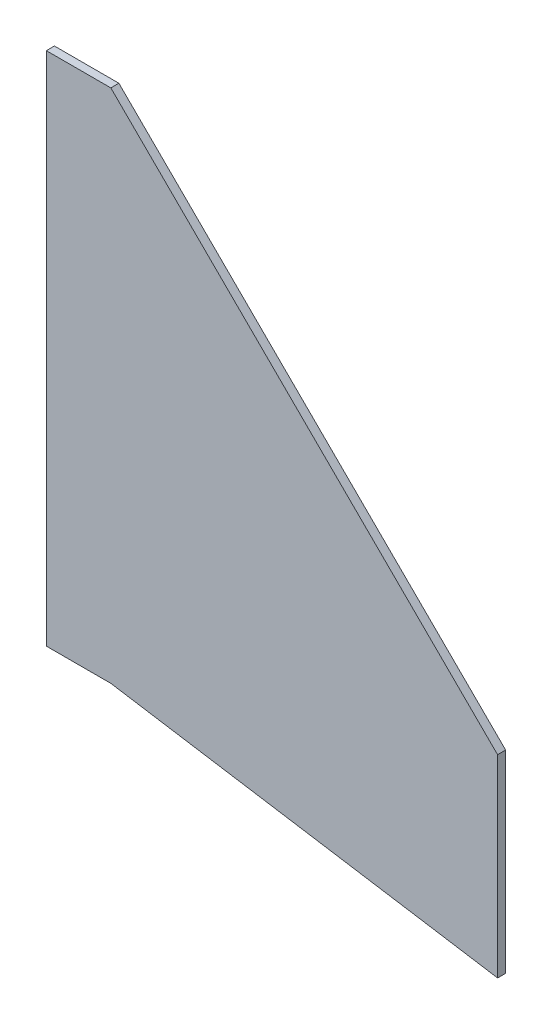
ISO-10303-21;
HEADER;
FILE_DESCRIPTION(('STEP AP214'),'2;1');
FILE_NAME('part.step','',(''),(''),'','','');
FILE_SCHEMA(('AUTOMOTIVE_DESIGN { 1 0 10303 214 1 1 1 1 }'));
ENDSEC;
DATA;
#1=APPLICATION_CONTEXT('core data for automotive mechanical design processes');
#2=APPLICATION_PROTOCOL_DEFINITION('international standard','automotive_design',2000,#1);
#3=PRODUCT_CONTEXT('',#1,'mechanical');
#4=PRODUCT('Part','Part','',(#3));
#5=PRODUCT_RELATED_PRODUCT_CATEGORY('part','',(#4));
#6=PRODUCT_DEFINITION_FORMATION('','',#4);
#7=PRODUCT_DEFINITION_CONTEXT('part definition',#1,'design');
#8=PRODUCT_DEFINITION('design','',#6,#7);
#9=PRODUCT_DEFINITION_SHAPE('','',#8);
#10=(LENGTH_UNIT() NAMED_UNIT(*) SI_UNIT(.MILLI.,.METRE.));
#11=(NAMED_UNIT(*) PLANE_ANGLE_UNIT() SI_UNIT($,.RADIAN.));
#12=(NAMED_UNIT(*) SI_UNIT($,.STERADIAN.) SOLID_ANGLE_UNIT());
#13=UNCERTAINTY_MEASURE_WITH_UNIT(LENGTH_MEASURE(1.E-05),#10,'distance_accuracy_value','');
#14=(GEOMETRIC_REPRESENTATION_CONTEXT(3) GLOBAL_UNCERTAINTY_ASSIGNED_CONTEXT((#13)) GLOBAL_UNIT_ASSIGNED_CONTEXT((#10,
#11,#12)) REPRESENTATION_CONTEXT('',''));
#15=CARTESIAN_POINT('',(0.,0.,0.));
#16=DIRECTION('',(0.,0.,1.));
#17=DIRECTION('',(1.,0.,0.));
#18=AXIS2_PLACEMENT_3D('',#15,#16,#17);
#19=CARTESIAN_POINT('',(-25.4,0.,1.5875));
#20=DIRECTION('',(1.,0.,0.));
#21=DIRECTION('',(0.,1.,0.));
#22=AXIS2_PLACEMENT_3D('',#19,#20,#21);
#23=PLANE('',#22);
#24=DIRECTION('',(0.,-1.,0.));
#25=VECTOR('',#24,1.);
#26=CARTESIAN_POINT('',(-25.4,0.,-1.5875));
#27=LINE('',#26,#25);
#28=CARTESIAN_POINT('',(-25.4,0.,-1.5875));
#29=VERTEX_POINT('',#28);
#30=CARTESIAN_POINT('',(-25.4,-203.2,-1.5875));
#31=VERTEX_POINT('',#30);
#32=EDGE_CURVE('E123',#29,#31,#27,.T.);
#33=ORIENTED_EDGE('',*,*,#32,.T.);
#34=DIRECTION('',(0.,0.,-1.));
#35=VECTOR('',#34,1.);
#36=CARTESIAN_POINT('',(-25.4,-203.2,1.5875));
#37=LINE('',#36,#35);
#38=CARTESIAN_POINT('',(-25.4,-203.2,1.5875));
#39=VERTEX_POINT('',#38);
#40=EDGE_CURVE('E11',#39,#31,#37,.T.);
#41=ORIENTED_EDGE('',*,*,#40,.F.);
#42=DIRECTION('',(0.,-1.,0.));
#43=VECTOR('',#42,1.);
#44=CARTESIAN_POINT('',(-25.4,0.,1.5875));
#45=LINE('',#44,#43);
#46=CARTESIAN_POINT('',(-25.4,0.,1.5875));
#47=VERTEX_POINT('',#46);
#48=EDGE_CURVE('E133',#47,#39,#45,.T.);
#49=ORIENTED_EDGE('',*,*,#48,.F.);
#50=DIRECTION('',(0.,0.,-1.));
#51=VECTOR('',#50,1.);
#52=CARTESIAN_POINT('',(-25.4,0.,1.5875));
#53=LINE('',#52,#51);
#54=EDGE_CURVE('E119',#47,#29,#53,.T.);
#55=ORIENTED_EDGE('',*,*,#54,.T.);
#56=EDGE_LOOP('',(#33,#41,#49,#55));
#57=FACE_BOUND('',#56,.T.);
#58=ADVANCED_FACE('F39',(#57),#23,.F.);
#59=CARTESIAN_POINT('',(0.,-203.2,1.5875));
#60=DIRECTION('',(0.,1.,0.));
#61=DIRECTION('',(0.,0.,1.));
#62=AXIS2_PLACEMENT_3D('',#59,#60,#61);
#63=PLANE('',#62);
#64=DIRECTION('',(1.,0.,0.));
#65=VECTOR('',#64,1.);
#66=CARTESIAN_POINT('',(0.,-203.2,-1.5875));
#67=LINE('',#66,#65);
#68=CARTESIAN_POINT('',(0.,-203.2,-1.5875));
#69=VERTEX_POINT('',#68);
#70=EDGE_CURVE('E126',#31,#69,#67,.T.);
#71=ORIENTED_EDGE('',*,*,#70,.T.);
#72=DIRECTION('',(0.,0.,-1.));
#73=VECTOR('',#72,1.);
#74=CARTESIAN_POINT('',(0.,-203.2,1.5875));
#75=LINE('',#74,#73);
#76=CARTESIAN_POINT('',(0.,-203.2,1.5875));
#77=VERTEX_POINT('',#76);
#78=EDGE_CURVE('E47',#77,#69,#75,.T.);
#79=ORIENTED_EDGE('',*,*,#78,.F.);
#80=DIRECTION('',(1.,0.,0.));
#81=VECTOR('',#80,1.);
#82=CARTESIAN_POINT('',(0.,-203.2,1.5875));
#83=LINE('',#82,#81);
#84=EDGE_CURVE('E92',#39,#77,#83,.T.);
#85=ORIENTED_EDGE('',*,*,#84,.F.);
#86=ORIENTED_EDGE('',*,*,#40,.T.);
#87=EDGE_LOOP('',(#71,#79,#85,#86));
#88=FACE_BOUND('',#87,.T.);
#89=ADVANCED_FACE('F157',(#88),#63,.F.);
#90=CARTESIAN_POINT('',(-31.6457975960785,-198.14586213043,1.5875));
#91=DIRECTION('',(0.157710892889718,0.987485328632243,0.));
#92=DIRECTION('',(-0.987485328632243,0.157710892889718,0.));
#93=AXIS2_PLACEMENT_3D('',#90,#91,#92);
#94=PLANE('',#93);
#95=DIRECTION('',(0.987485328632243,-0.157710892889718,0.));
#96=VECTOR('',#95,1.);
#97=CARTESIAN_POINT('',(-31.6457975960785,-198.14586213043,-1.5875));
#98=LINE('',#97,#96);
#99=CARTESIAN_POINT('',(152.4,-227.539743973395,-1.5875));
#100=VERTEX_POINT('',#99);
#101=EDGE_CURVE('E128',#69,#100,#98,.T.);
#102=ORIENTED_EDGE('',*,*,#101,.T.);
#103=DIRECTION('',(0.,0.,-1.));
#104=VECTOR('',#103,1.);
#105=CARTESIAN_POINT('',(152.4,-227.539743973395,1.5875));
#106=LINE('',#105,#104);
#107=CARTESIAN_POINT('',(152.4,-227.539743973395,1.5875));
#108=VERTEX_POINT('',#107);
#109=EDGE_CURVE('E114',#108,#100,#106,.T.);
#110=ORIENTED_EDGE('',*,*,#109,.F.);
#111=DIRECTION('',(0.987485328632243,-0.157710892889718,0.));
#112=VECTOR('',#111,1.);
#113=CARTESIAN_POINT('',(-31.6457975960785,-198.14586213043,1.5875));
#114=LINE('',#113,#112);
#115=EDGE_CURVE('E105',#77,#108,#114,.T.);
#116=ORIENTED_EDGE('',*,*,#115,.F.);
#117=ORIENTED_EDGE('',*,*,#78,.T.);
#118=EDGE_LOOP('',(#102,#110,#116,#117));
#119=FACE_BOUND('',#118,.T.);
#120=ADVANCED_FACE('F139',(#119),#94,.F.);
#121=CARTESIAN_POINT('',(152.4,0.,1.5875));
#122=DIRECTION('',(-1.,0.,0.));
#123=DIRECTION('',(0.,-1.,0.));
#124=AXIS2_PLACEMENT_3D('',#121,#122,#123);
#125=PLANE('',#124);
#126=DIRECTION('',(0.,1.,0.));
#127=VECTOR('',#126,1.);
#128=CARTESIAN_POINT('',(152.4,0.,-1.5875));
#129=LINE('',#128,#127);
#130=CARTESIAN_POINT('',(152.4,-151.339743973395,-1.5875));
#131=VERTEX_POINT('',#130);
#132=EDGE_CURVE('E113',#100,#131,#129,.T.);
#133=ORIENTED_EDGE('',*,*,#132,.T.);
#134=DIRECTION('',(0.,0.,-1.));
#135=VECTOR('',#134,1.);
#136=CARTESIAN_POINT('',(152.4,-151.339743973395,1.5875));
#137=LINE('',#136,#135);
#138=CARTESIAN_POINT('',(152.4,-151.339743973395,1.5875));
#139=VERTEX_POINT('',#138);
#140=EDGE_CURVE('E110',#139,#131,#137,.T.);
#141=ORIENTED_EDGE('',*,*,#140,.F.);
#142=DIRECTION('',(0.,1.,0.));
#143=VECTOR('',#142,1.);
#144=CARTESIAN_POINT('',(152.4,0.,1.5875));
#145=LINE('',#144,#143);
#146=EDGE_CURVE('E99',#108,#139,#145,.T.);
#147=ORIENTED_EDGE('',*,*,#146,.F.);
#148=ORIENTED_EDGE('',*,*,#109,.T.);
#149=EDGE_LOOP('',(#133,#141,#147,#148));
#150=FACE_BOUND('',#149,.T.);
#151=ADVANCED_FACE('F111',(#150),#125,.F.);
#152=CARTESIAN_POINT('',(0.,0.,1.5875));
#153=DIRECTION('',(-0.70463420996359,-0.709570736536525,0.));
#154=DIRECTION('',(0.709570736536525,-0.704634209963591,0.));
#155=AXIS2_PLACEMENT_3D('',#152,#153,#154);
#156=PLANE('',#155);
#157=DIRECTION('',(-0.709570736536525,0.704634209963591,0.));
#158=VECTOR('',#157,1.);
#159=CARTESIAN_POINT('',(0.,0.,-1.5875));
#160=LINE('',#159,#158);
#161=CARTESIAN_POINT('',(0.,0.,-1.5875));
#162=VERTEX_POINT('',#161);
#163=EDGE_CURVE('E78',#131,#162,#160,.T.);
#164=ORIENTED_EDGE('',*,*,#163,.T.);
#165=DIRECTION('',(0.,0.,-1.));
#166=VECTOR('',#165,1.);
#167=CARTESIAN_POINT('',(0.,0.,1.5875));
#168=LINE('',#167,#166);
#169=CARTESIAN_POINT('',(0.,0.,1.5875));
#170=VERTEX_POINT('',#169);
#171=EDGE_CURVE('E115',#170,#162,#168,.T.);
#172=ORIENTED_EDGE('',*,*,#171,.F.);
#173=DIRECTION('',(-0.709570736536525,0.704634209963591,0.));
#174=VECTOR('',#173,1.);
#175=CARTESIAN_POINT('',(0.,0.,1.5875));
#176=LINE('',#175,#174);
#177=EDGE_CURVE('E103',#139,#170,#176,.T.);
#178=ORIENTED_EDGE('',*,*,#177,.F.);
#179=ORIENTED_EDGE('',*,*,#140,.T.);
#180=EDGE_LOOP('',(#164,#172,#178,#179));
#181=FACE_BOUND('',#180,.T.);
#182=ADVANCED_FACE('F117',(#181),#156,.F.);
#183=CARTESIAN_POINT('',(0.,0.,1.5875));
#184=DIRECTION('',(0.,-1.,0.));
#185=DIRECTION('',(1.,0.,0.));
#186=AXIS2_PLACEMENT_3D('',#183,#184,#185);
#187=PLANE('',#186);
#188=DIRECTION('',(-1.,0.,0.));
#189=VECTOR('',#188,1.);
#190=CARTESIAN_POINT('',(0.,0.,-1.5875));
#191=LINE('',#190,#189);
#192=EDGE_CURVE('E84',#162,#29,#191,.T.);
#193=ORIENTED_EDGE('',*,*,#192,.T.);
#194=ORIENTED_EDGE('',*,*,#54,.F.);
#195=DIRECTION('',(-1.,0.,0.));
#196=VECTOR('',#195,1.);
#197=CARTESIAN_POINT('',(0.,0.,1.5875));
#198=LINE('',#197,#196);
#199=EDGE_CURVE('E55',#170,#47,#198,.T.);
#200=ORIENTED_EDGE('',*,*,#199,.F.);
#201=ORIENTED_EDGE('',*,*,#171,.T.);
#202=EDGE_LOOP('',(#193,#194,#200,#201));
#203=FACE_BOUND('',#202,.T.);
#204=ADVANCED_FACE('F146',(#203),#187,.F.);
#205=CARTESIAN_POINT('',(0.,0.,1.5875));
#206=DIRECTION('',(0.,0.,1.));
#207=DIRECTION('',(1.,0.,0.));
#208=AXIS2_PLACEMENT_3D('',#205,#206,#207);
#209=PLANE('',#208);
#210=ORIENTED_EDGE('',*,*,#48,.T.);
#211=ORIENTED_EDGE('',*,*,#84,.T.);
#212=ORIENTED_EDGE('',*,*,#115,.T.);
#213=ORIENTED_EDGE('',*,*,#146,.T.);
#214=ORIENTED_EDGE('',*,*,#177,.T.);
#215=ORIENTED_EDGE('',*,*,#199,.T.);
#216=EDGE_LOOP('',(#210,#211,#212,#213,#214,#215));
#217=FACE_BOUND('',#216,.T.);
#218=ADVANCED_FACE('F101',(#217),#209,.T.);
#219=CARTESIAN_POINT('',(0.,0.,-1.5875));
#220=DIRECTION('',(0.,0.,1.));
#221=DIRECTION('',(1.,0.,0.));
#222=AXIS2_PLACEMENT_3D('',#219,#220,#221);
#223=PLANE('',#222);
#224=ORIENTED_EDGE('',*,*,#32,.F.);
#225=ORIENTED_EDGE('',*,*,#192,.F.);
#226=ORIENTED_EDGE('',*,*,#163,.F.);
#227=ORIENTED_EDGE('',*,*,#132,.F.);
#228=ORIENTED_EDGE('',*,*,#101,.F.);
#229=ORIENTED_EDGE('',*,*,#70,.F.);
#230=EDGE_LOOP('',(#224,#225,#226,#227,#228,#229));
#231=FACE_BOUND('',#230,.T.);
#232=ADVANCED_FACE('F142',(#231),#223,.F.);
#233=CLOSED_SHELL('',(#58,#89,#120,#151,#182,#204,#218,#232));
#234=MANIFOLD_SOLID_BREP('B2',#233);
#235=ADVANCED_BREP_SHAPE_REPRESENTATION('',(#18,#234),#14);
#236=SHAPE_DEFINITION_REPRESENTATION(#9,#235);
ENDSEC;
END-ISO-10303-21;
